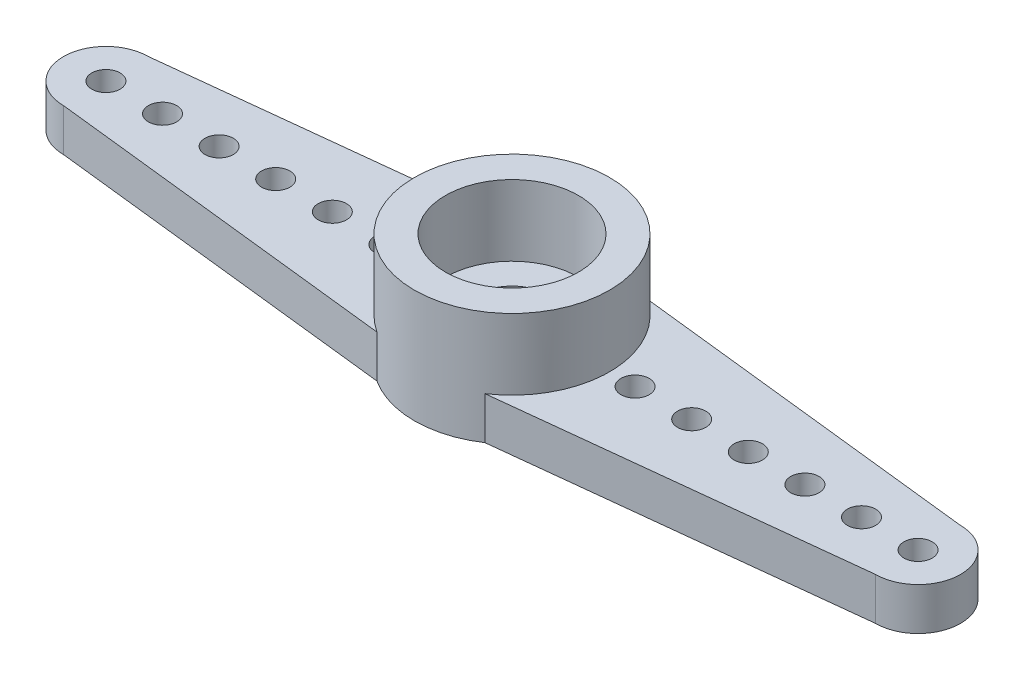
ISO-10303-21;
HEADER;
FILE_DESCRIPTION(('STEP AP214'),'2;1');
FILE_NAME('part.step','',(''),(''),'','','');
FILE_SCHEMA(('AUTOMOTIVE_DESIGN { 1 0 10303 214 1 1 1 1 }'));
ENDSEC;
DATA;
#1=APPLICATION_CONTEXT('core data for automotive mechanical design processes');
#2=APPLICATION_PROTOCOL_DEFINITION('international standard','automotive_design',2000,#1);
#3=PRODUCT_CONTEXT('',#1,'mechanical');
#4=PRODUCT('Part','Part','',(#3));
#5=PRODUCT_RELATED_PRODUCT_CATEGORY('part','',(#4));
#6=PRODUCT_DEFINITION_FORMATION('','',#4);
#7=PRODUCT_DEFINITION_CONTEXT('part definition',#1,'design');
#8=PRODUCT_DEFINITION('design','',#6,#7);
#9=PRODUCT_DEFINITION_SHAPE('','',#8);
#10=(LENGTH_UNIT() NAMED_UNIT(*) SI_UNIT(.MILLI.,.METRE.));
#11=(NAMED_UNIT(*) PLANE_ANGLE_UNIT() SI_UNIT($,.RADIAN.));
#12=(NAMED_UNIT(*) SI_UNIT($,.STERADIAN.) SOLID_ANGLE_UNIT());
#13=UNCERTAINTY_MEASURE_WITH_UNIT(LENGTH_MEASURE(1.E-05),#10,'distance_accuracy_value','');
#14=(GEOMETRIC_REPRESENTATION_CONTEXT(3) GLOBAL_UNCERTAINTY_ASSIGNED_CONTEXT((#13)) GLOBAL_UNIT_ASSIGNED_CONTEXT((#10,
#11,#12)) REPRESENTATION_CONTEXT('',''));
#15=CARTESIAN_POINT('',(0.,0.,0.));
#16=DIRECTION('',(0.,0.,1.));
#17=DIRECTION('',(1.,0.,0.));
#18=AXIS2_PLACEMENT_3D('',#15,#16,#17);
#19=CARTESIAN_POINT('',(0.,1.5,0.));
#20=DIRECTION('',(0.,1.,0.));
#21=DIRECTION('',(0.,0.,1.));
#22=AXIS2_PLACEMENT_3D('',#19,#20,#21);
#23=PLANE('',#22);
#24=CARTESIAN_POINT('',(0.,1.5,0.));
#25=DIRECTION('',(0.,1.,0.));
#26=DIRECTION('',(0.,0.,1.));
#27=AXIS2_PLACEMENT_3D('',#24,#25,#26);
#28=CIRCLE('',#27,1.275);
#29=CARTESIAN_POINT('',(0.,1.5,1.275));
#30=VERTEX_POINT('',#29);
#31=EDGE_CURVE('E40',#30,#30,#28,.T.);
#32=ORIENTED_EDGE('',*,*,#31,.F.);
#33=EDGE_LOOP('',(#32));
#34=FACE_BOUND('',#33,.T.);
#35=CARTESIAN_POINT('',(0.,1.5,0.));
#36=DIRECTION('',(0.,1.,0.));
#37=DIRECTION('',(0.,0.,1.));
#38=AXIS2_PLACEMENT_3D('',#35,#36,#37);
#39=CIRCLE('',#38,2.35);
#40=CARTESIAN_POINT('',(0.,1.5,2.35));
#41=VERTEX_POINT('',#40);
#42=EDGE_CURVE('E202',#41,#41,#39,.T.);
#43=ORIENTED_EDGE('',*,*,#42,.T.);
#44=EDGE_LOOP('',(#43));
#45=FACE_BOUND('',#44,.T.);
#46=ADVANCED_FACE('F36',(#34,#45),#23,.T.);
#47=CARTESIAN_POINT('',(0.,1.5,0.));
#48=DIRECTION('',(0.,1.,0.));
#49=DIRECTION('',(0.,0.,1.));
#50=AXIS2_PLACEMENT_3D('',#47,#48,#49);
#51=CIRCLE('',#50,3.45);
#52=CARTESIAN_POINT('',(1.913197247407,1.5,2.87091906756604));
#53=VERTEX_POINT('',#52);
#54=CARTESIAN_POINT('',(1.87974276835085,1.5,-2.89293399939105));
#55=VERTEX_POINT('',#54);
#56=EDGE_CURVE('E48',#53,#55,#51,.T.);
#57=ORIENTED_EDGE('',*,*,#56,.F.);
#58=DIRECTION('',(0.993979393584622,0.,-0.109567171767582));
#59=VECTOR('',#58,1.);
#60=CARTESIAN_POINT('',(1.913197247407,1.5,2.87091906756604));
#61=LINE('',#60,#59);
#62=CARTESIAN_POINT('',(14.35,1.5,1.5));
#63=VERTEX_POINT('',#62);
#64=EDGE_CURVE('E56',#53,#63,#61,.T.);
#65=ORIENTED_EDGE('',*,*,#64,.T.);
#66=CARTESIAN_POINT('',(14.35,1.5,0.));
#67=DIRECTION('',(0.,1.,0.));
#68=DIRECTION('',(0.,0.,1.));
#69=AXIS2_PLACEMENT_3D('',#66,#67,#68);
#70=CIRCLE('',#69,1.5);
#71=CARTESIAN_POINT('',(14.35,1.5,-1.5));
#72=VERTEX_POINT('',#71);
#73=EDGE_CURVE('E158',#63,#72,#70,.T.);
#74=ORIENTED_EDGE('',*,*,#73,.T.);
#75=DIRECTION('',(-0.993819276776604,0.,-0.111010112634965));
#76=VECTOR('',#75,1.);
#77=CARTESIAN_POINT('',(14.35,1.5,-1.5));
#78=LINE('',#77,#76);
#79=EDGE_CURVE('E102',#72,#55,#78,.T.);
#80=ORIENTED_EDGE('',*,*,#79,.T.);
#81=EDGE_LOOP('',(#57,#65,#74,#80));
#82=FACE_BOUND('',#81,.T.);
#83=CARTESIAN_POINT('',(4.35,1.5,0.));
#84=DIRECTION('',(0.,1.,0.));
#85=DIRECTION('',(0.,0.,1.));
#86=AXIS2_PLACEMENT_3D('',#83,#84,#85);
#87=CIRCLE('',#86,0.500000000000001);
#88=CARTESIAN_POINT('',(4.35,1.5,0.500000000000001));
#89=VERTEX_POINT('',#88);
#90=EDGE_CURVE('E248',#89,#89,#87,.T.);
#91=ORIENTED_EDGE('',*,*,#90,.F.);
#92=EDGE_LOOP('',(#91));
#93=FACE_BOUND('',#92,.T.);
#94=CARTESIAN_POINT('',(14.35,1.5,0.));
#95=DIRECTION('',(0.,1.,0.));
#96=DIRECTION('',(0.,0.,1.));
#97=AXIS2_PLACEMENT_3D('',#94,#95,#96);
#98=CIRCLE('',#97,0.499999999999999);
#99=CARTESIAN_POINT('',(14.35,1.5,0.499999999999999));
#100=VERTEX_POINT('',#99);
#101=EDGE_CURVE('E260',#100,#100,#98,.T.);
#102=ORIENTED_EDGE('',*,*,#101,.F.);
#103=EDGE_LOOP('',(#102));
#104=FACE_BOUND('',#103,.T.);
#105=CARTESIAN_POINT('',(10.35,1.5,0.));
#106=DIRECTION('',(0.,1.,0.));
#107=DIRECTION('',(0.,0.,1.));
#108=AXIS2_PLACEMENT_3D('',#105,#106,#107);
#109=CIRCLE('',#108,0.500000000000001);
#110=CARTESIAN_POINT('',(10.35,1.5,0.500000000000001));
#111=VERTEX_POINT('',#110);
#112=EDGE_CURVE('E272',#111,#111,#109,.T.);
#113=ORIENTED_EDGE('',*,*,#112,.F.);
#114=EDGE_LOOP('',(#113));
#115=FACE_BOUND('',#114,.T.);
#116=CARTESIAN_POINT('',(12.35,1.5,0.));
#117=DIRECTION('',(0.,1.,0.));
#118=DIRECTION('',(0.,0.,1.));
#119=AXIS2_PLACEMENT_3D('',#116,#117,#118);
#120=CIRCLE('',#119,0.500000000000001);
#121=CARTESIAN_POINT('',(12.35,1.5,0.500000000000001));
#122=VERTEX_POINT('',#121);
#123=EDGE_CURVE('E278',#122,#122,#120,.T.);
#124=ORIENTED_EDGE('',*,*,#123,.F.);
#125=EDGE_LOOP('',(#124));
#126=FACE_BOUND('',#125,.T.);
#127=CARTESIAN_POINT('',(8.35,1.5,0.));
#128=DIRECTION('',(0.,1.,0.));
#129=DIRECTION('',(0.,0.,1.));
#130=AXIS2_PLACEMENT_3D('',#127,#128,#129);
#131=CIRCLE('',#130,0.500000000000001);
#132=CARTESIAN_POINT('',(8.35,1.5,0.500000000000001));
#133=VERTEX_POINT('',#132);
#134=EDGE_CURVE('E266',#133,#133,#131,.T.);
#135=ORIENTED_EDGE('',*,*,#134,.F.);
#136=EDGE_LOOP('',(#135));
#137=FACE_BOUND('',#136,.T.);
#138=CARTESIAN_POINT('',(6.35,1.5,0.));
#139=DIRECTION('',(0.,1.,0.));
#140=DIRECTION('',(0.,0.,1.));
#141=AXIS2_PLACEMENT_3D('',#138,#139,#140);
#142=CIRCLE('',#141,0.5);
#143=CARTESIAN_POINT('',(6.35,1.5,0.5));
#144=VERTEX_POINT('',#143);
#145=EDGE_CURVE('E254',#144,#144,#142,.T.);
#146=ORIENTED_EDGE('',*,*,#145,.F.);
#147=EDGE_LOOP('',(#146));
#148=FACE_BOUND('',#147,.T.);
#149=ADVANCED_FACE('F188',(#82,#93,#104,#115,#126,#137,#148),#23,.T.);
#150=CARTESIAN_POINT('',(0.,1.,0.));
#151=DIRECTION('',(0.,1.,0.));
#152=DIRECTION('',(0.,0.,1.));
#153=AXIS2_PLACEMENT_3D('',#150,#151,#152);
#154=CYLINDRICAL_SURFACE('',#153,1.275);
#155=CARTESIAN_POINT('',(0.,1.,0.));
#156=DIRECTION('',(0.,1.,0.));
#157=DIRECTION('',(0.,0.,1.));
#158=AXIS2_PLACEMENT_3D('',#155,#156,#157);
#159=CIRCLE('',#158,1.275);
#160=CARTESIAN_POINT('',(0.,1.,1.275));
#161=VERTEX_POINT('',#160);
#162=EDGE_CURVE('E172',#161,#161,#159,.T.);
#163=ORIENTED_EDGE('',*,*,#162,.F.);
#164=EDGE_LOOP('',(#163));
#165=FACE_BOUND('',#164,.T.);
#166=ORIENTED_EDGE('',*,*,#31,.T.);
#167=EDGE_LOOP('',(#166));
#168=FACE_BOUND('',#167,.T.);
#169=ADVANCED_FACE('F38',(#165,#168),#154,.F.);
#170=CARTESIAN_POINT('',(0.,1.,0.));
#171=DIRECTION('',(0.,1.,0.));
#172=DIRECTION('',(0.,0.,1.));
#173=AXIS2_PLACEMENT_3D('',#170,#171,#172);
#174=PLANE('',#173);
#175=ORIENTED_EDGE('',*,*,#162,.T.);
#176=EDGE_LOOP('',(#175));
#177=FACE_BOUND('',#176,.T.);
#178=CARTESIAN_POINT('',(0.,1.,0.));
#179=DIRECTION('',(0.,1.,0.));
#180=DIRECTION('',(0.,0.,1.));
#181=AXIS2_PLACEMENT_3D('',#178,#179,#180);
#182=CIRCLE('',#181,2.35);
#183=CARTESIAN_POINT('',(0.,1.,2.35));
#184=VERTEX_POINT('',#183);
#185=EDGE_CURVE('E46',#184,#184,#182,.T.);
#186=ORIENTED_EDGE('',*,*,#185,.F.);
#187=EDGE_LOOP('',(#186));
#188=FACE_BOUND('',#187,.T.);
#189=ADVANCED_FACE('F179',(#177,#188),#174,.F.);
#190=CARTESIAN_POINT('',(-1.91319724740702,1.5,-2.87091906756603));
#191=VERTEX_POINT('',#190);
#192=CARTESIAN_POINT('',(-1.87974276835083,1.5,2.89293399939107));
#193=VERTEX_POINT('',#192);
#194=EDGE_CURVE('E11',#191,#193,#51,.T.);
#195=ORIENTED_EDGE('',*,*,#194,.F.);
#196=DIRECTION('',(-0.993979393584622,0.,0.109567171767589));
#197=VECTOR('',#196,1.);
#198=CARTESIAN_POINT('',(-1.91319724740702,1.5,-2.87091906756603));
#199=LINE('',#198,#197);
#200=CARTESIAN_POINT('',(-14.35,1.5,-1.4999999999999));
#201=VERTEX_POINT('',#200);
#202=EDGE_CURVE('E122',#191,#201,#199,.T.);
#203=ORIENTED_EDGE('',*,*,#202,.T.);
#204=CARTESIAN_POINT('',(-14.35,1.5,1.00613961606655E-13));
#205=DIRECTION('',(0.,1.,0.));
#206=DIRECTION('',(0.,0.,1.));
#207=AXIS2_PLACEMENT_3D('',#204,#205,#206);
#208=CIRCLE('',#207,1.5);
#209=CARTESIAN_POINT('',(-14.35,1.5,1.5000000000001));
#210=VERTEX_POINT('',#209);
#211=EDGE_CURVE('E114',#201,#210,#208,.T.);
#212=ORIENTED_EDGE('',*,*,#211,.T.);
#213=DIRECTION('',(0.993819276776605,0.,0.111010112634958));
#214=VECTOR('',#213,1.);
#215=CARTESIAN_POINT('',(-14.35,1.5,1.5000000000001));
#216=LINE('',#215,#214);
#217=EDGE_CURVE('E119',#210,#193,#216,.T.);
#218=ORIENTED_EDGE('',*,*,#217,.T.);
#219=EDGE_LOOP('',(#195,#203,#212,#218));
#220=FACE_BOUND('',#219,.T.);
#221=CARTESIAN_POINT('',(-6.35,1.5,0.));
#222=DIRECTION('',(0.,1.,0.));
#223=DIRECTION('',(0.,0.,1.));
#224=AXIS2_PLACEMENT_3D('',#221,#222,#223);
#225=CIRCLE('',#224,0.5);
#226=CARTESIAN_POINT('',(-6.35,1.5,0.500000000000044));
#227=VERTEX_POINT('',#226);
#228=EDGE_CURVE('E218',#227,#227,#225,.T.);
#229=ORIENTED_EDGE('',*,*,#228,.F.);
#230=EDGE_LOOP('',(#229));
#231=FACE_BOUND('',#230,.T.);
#232=CARTESIAN_POINT('',(-8.35,1.5,0.));
#233=DIRECTION('',(0.,1.,0.));
#234=DIRECTION('',(0.,0.,1.));
#235=AXIS2_PLACEMENT_3D('',#232,#233,#234);
#236=CIRCLE('',#235,0.5);
#237=CARTESIAN_POINT('',(-8.35,1.5,0.500000000000058));
#238=VERTEX_POINT('',#237);
#239=EDGE_CURVE('E230',#238,#238,#236,.T.);
#240=ORIENTED_EDGE('',*,*,#239,.F.);
#241=EDGE_LOOP('',(#240));
#242=FACE_BOUND('',#241,.T.);
#243=CARTESIAN_POINT('',(-12.35,1.5,0.));
#244=DIRECTION('',(0.,1.,0.));
#245=DIRECTION('',(0.,0.,1.));
#246=AXIS2_PLACEMENT_3D('',#243,#244,#245);
#247=CIRCLE('',#246,0.500000000000003);
#248=CARTESIAN_POINT('',(-12.35,1.5,0.50000000000009));
#249=VERTEX_POINT('',#248);
#250=EDGE_CURVE('E242',#249,#249,#247,.T.);
#251=ORIENTED_EDGE('',*,*,#250,.F.);
#252=EDGE_LOOP('',(#251));
#253=FACE_BOUND('',#252,.T.);
#254=CARTESIAN_POINT('',(-10.35,1.5,0.));
#255=DIRECTION('',(0.,1.,0.));
#256=DIRECTION('',(0.,0.,1.));
#257=AXIS2_PLACEMENT_3D('',#254,#255,#256);
#258=CIRCLE('',#257,0.5);
#259=CARTESIAN_POINT('',(-10.35,1.5,0.500000000000073));
#260=VERTEX_POINT('',#259);
#261=EDGE_CURVE('E236',#260,#260,#258,.T.);
#262=ORIENTED_EDGE('',*,*,#261,.F.);
#263=EDGE_LOOP('',(#262));
#264=FACE_BOUND('',#263,.T.);
#265=CARTESIAN_POINT('',(-14.35,1.5,1.00613961606655E-13));
#266=DIRECTION('',(0.,1.,0.));
#267=DIRECTION('',(0.,0.,1.));
#268=AXIS2_PLACEMENT_3D('',#265,#266,#267);
#269=CIRCLE('',#268,0.499999999999997);
#270=CARTESIAN_POINT('',(-14.35,1.5,0.500000000000097));
#271=VERTEX_POINT('',#270);
#272=EDGE_CURVE('E224',#271,#271,#269,.T.);
#273=ORIENTED_EDGE('',*,*,#272,.F.);
#274=EDGE_LOOP('',(#273));
#275=FACE_BOUND('',#274,.T.);
#276=CARTESIAN_POINT('',(-4.35,1.5,0.));
#277=DIRECTION('',(0.,1.,0.));
#278=DIRECTION('',(0.,0.,1.));
#279=AXIS2_PLACEMENT_3D('',#276,#277,#278);
#280=CIRCLE('',#279,0.5);
#281=CARTESIAN_POINT('',(-4.35,1.5,0.500000000000031));
#282=VERTEX_POINT('',#281);
#283=EDGE_CURVE('E211',#282,#282,#280,.T.);
#284=ORIENTED_EDGE('',*,*,#283,.F.);
#285=EDGE_LOOP('',(#284));
#286=FACE_BOUND('',#285,.T.);
#287=ADVANCED_FACE('F116',(#220,#231,#242,#253,#264,#275,#286),#23,.T.);
#288=CARTESIAN_POINT('',(0.,1.5,0.));
#289=DIRECTION('',(0.,-1.,0.));
#290=DIRECTION('',(0.,0.,-1.));
#291=AXIS2_PLACEMENT_3D('',#288,#289,#290);
#292=CYLINDRICAL_SURFACE('',#291,2.35);
#293=CARTESIAN_POINT('',(0.,0.,0.));
#294=DIRECTION('',(0.,1.,0.));
#295=DIRECTION('',(0.,0.,1.));
#296=AXIS2_PLACEMENT_3D('',#293,#294,#295);
#297=CIRCLE('',#296,2.35);
#298=CARTESIAN_POINT('',(0.,0.,2.35));
#299=VERTEX_POINT('',#298);
#300=EDGE_CURVE('E147',#299,#299,#297,.T.);
#301=ORIENTED_EDGE('',*,*,#300,.F.);
#302=EDGE_LOOP('',(#301));
#303=FACE_BOUND('',#302,.T.);
#304=ORIENTED_EDGE('',*,*,#185,.T.);
#305=EDGE_LOOP('',(#304));
#306=FACE_BOUND('',#305,.T.);
#307=ADVANCED_FACE('F177',(#303,#306),#292,.F.);
#308=CARTESIAN_POINT('',(14.35,0.,0.));
#309=DIRECTION('',(0.,1.,0.));
#310=DIRECTION('',(0.,0.,1.));
#311=AXIS2_PLACEMENT_3D('',#308,#309,#310);
#312=PLANE('',#311);
#313=CARTESIAN_POINT('',(14.35,0.,0.));
#314=DIRECTION('',(0.,1.,0.));
#315=DIRECTION('',(0.,0.,1.));
#316=AXIS2_PLACEMENT_3D('',#313,#314,#315);
#317=CIRCLE('',#316,1.5);
#318=CARTESIAN_POINT('',(14.35,0.,1.5));
#319=VERTEX_POINT('',#318);
#320=CARTESIAN_POINT('',(14.35,0.,-1.5));
#321=VERTEX_POINT('',#320);
#322=EDGE_CURVE('E143',#319,#321,#317,.T.);
#323=ORIENTED_EDGE('',*,*,#322,.F.);
#324=DIRECTION('',(0.993979393584622,0.,-0.109567171767582));
#325=VECTOR('',#324,1.);
#326=CARTESIAN_POINT('',(1.913197247407,0.,2.87091906756604));
#327=LINE('',#326,#325);
#328=CARTESIAN_POINT('',(1.913197247407,0.,2.87091906756604));
#329=VERTEX_POINT('',#328);
#330=EDGE_CURVE('E93',#329,#319,#327,.T.);
#331=ORIENTED_EDGE('',*,*,#330,.F.);
#332=CARTESIAN_POINT('',(0.,0.,0.));
#333=DIRECTION('',(0.,1.,0.));
#334=DIRECTION('',(0.,0.,1.));
#335=AXIS2_PLACEMENT_3D('',#332,#333,#334);
#336=CIRCLE('',#335,3.45);
#337=CARTESIAN_POINT('',(-1.87974276835083,0.,2.89293399939107));
#338=VERTEX_POINT('',#337);
#339=EDGE_CURVE('E87',#338,#329,#336,.T.);
#340=ORIENTED_EDGE('',*,*,#339,.F.);
#341=DIRECTION('',(0.993819276776605,0.,0.111010112634958));
#342=VECTOR('',#341,1.);
#343=CARTESIAN_POINT('',(-14.35,0.,1.5000000000001));
#344=LINE('',#343,#342);
#345=CARTESIAN_POINT('',(-14.35,0.,1.5000000000001));
#346=VERTEX_POINT('',#345);
#347=EDGE_CURVE('E154',#346,#338,#344,.T.);
#348=ORIENTED_EDGE('',*,*,#347,.F.);
#349=CARTESIAN_POINT('',(-14.35,0.,1.00613961606655E-13));
#350=DIRECTION('',(0.,1.,0.));
#351=DIRECTION('',(0.,0.,1.));
#352=AXIS2_PLACEMENT_3D('',#349,#350,#351);
#353=CIRCLE('',#352,1.5);
#354=CARTESIAN_POINT('',(-14.35,0.,-1.4999999999999));
#355=VERTEX_POINT('',#354);
#356=EDGE_CURVE('E131',#355,#346,#353,.T.);
#357=ORIENTED_EDGE('',*,*,#356,.F.);
#358=DIRECTION('',(-0.993979393584622,0.,0.109567171767589));
#359=VECTOR('',#358,1.);
#360=CARTESIAN_POINT('',(-1.91319724740702,0.,-2.87091906756603));
#361=LINE('',#360,#359);
#362=CARTESIAN_POINT('',(-1.91319724740702,0.,-2.87091906756603));
#363=VERTEX_POINT('',#362);
#364=EDGE_CURVE('E151',#363,#355,#361,.T.);
#365=ORIENTED_EDGE('',*,*,#364,.F.);
#366=CARTESIAN_POINT('',(0.,0.,0.));
#367=DIRECTION('',(0.,1.,0.));
#368=DIRECTION('',(0.,0.,1.));
#369=AXIS2_PLACEMENT_3D('',#366,#367,#368);
#370=CIRCLE('',#369,3.45);
#371=CARTESIAN_POINT('',(1.87974276835085,0.,-2.89293399939105));
#372=VERTEX_POINT('',#371);
#373=EDGE_CURVE('E149',#372,#363,#370,.T.);
#374=ORIENTED_EDGE('',*,*,#373,.F.);
#375=DIRECTION('',(-0.993819276776604,0.,-0.111010112634965));
#376=VECTOR('',#375,1.);
#377=CARTESIAN_POINT('',(14.35,0.,-1.5));
#378=LINE('',#377,#376);
#379=EDGE_CURVE('E146',#321,#372,#378,.T.);
#380=ORIENTED_EDGE('',*,*,#379,.F.);
#381=EDGE_LOOP('',(#323,#331,#340,#348,#357,#365,#374,#380));
#382=FACE_BOUND('',#381,.T.);
#383=ORIENTED_EDGE('',*,*,#300,.T.);
#384=EDGE_LOOP('',(#383));
#385=FACE_BOUND('',#384,.T.);
#386=CARTESIAN_POINT('',(12.35,0.,0.));
#387=DIRECTION('',(0.,1.,0.));
#388=DIRECTION('',(0.,0.,1.));
#389=AXIS2_PLACEMENT_3D('',#386,#387,#388);
#390=CIRCLE('',#389,0.500000000000001);
#391=CARTESIAN_POINT('',(12.35,0.,0.500000000000001));
#392=VERTEX_POINT('',#391);
#393=EDGE_CURVE('E275',#392,#392,#390,.T.);
#394=ORIENTED_EDGE('',*,*,#393,.T.);
#395=EDGE_LOOP('',(#394));
#396=FACE_BOUND('',#395,.T.);
#397=CARTESIAN_POINT('',(10.35,0.,0.));
#398=DIRECTION('',(0.,1.,0.));
#399=DIRECTION('',(0.,0.,1.));
#400=AXIS2_PLACEMENT_3D('',#397,#398,#399);
#401=CIRCLE('',#400,0.500000000000001);
#402=CARTESIAN_POINT('',(10.35,0.,0.500000000000001));
#403=VERTEX_POINT('',#402);
#404=EDGE_CURVE('E269',#403,#403,#401,.T.);
#405=ORIENTED_EDGE('',*,*,#404,.T.);
#406=EDGE_LOOP('',(#405));
#407=FACE_BOUND('',#406,.T.);
#408=CARTESIAN_POINT('',(8.35,0.,0.));
#409=DIRECTION('',(0.,1.,0.));
#410=DIRECTION('',(0.,0.,1.));
#411=AXIS2_PLACEMENT_3D('',#408,#409,#410);
#412=CIRCLE('',#411,0.500000000000001);
#413=CARTESIAN_POINT('',(8.35,0.,0.500000000000001));
#414=VERTEX_POINT('',#413);
#415=EDGE_CURVE('E263',#414,#414,#412,.T.);
#416=ORIENTED_EDGE('',*,*,#415,.T.);
#417=EDGE_LOOP('',(#416));
#418=FACE_BOUND('',#417,.T.);
#419=CARTESIAN_POINT('',(14.35,0.,0.));
#420=DIRECTION('',(0.,1.,0.));
#421=DIRECTION('',(0.,0.,1.));
#422=AXIS2_PLACEMENT_3D('',#419,#420,#421);
#423=CIRCLE('',#422,0.499999999999999);
#424=CARTESIAN_POINT('',(14.35,0.,0.499999999999999));
#425=VERTEX_POINT('',#424);
#426=EDGE_CURVE('E257',#425,#425,#423,.T.);
#427=ORIENTED_EDGE('',*,*,#426,.T.);
#428=EDGE_LOOP('',(#427));
#429=FACE_BOUND('',#428,.T.);
#430=CARTESIAN_POINT('',(6.35,0.,0.));
#431=DIRECTION('',(0.,1.,0.));
#432=DIRECTION('',(0.,0.,1.));
#433=AXIS2_PLACEMENT_3D('',#430,#431,#432);
#434=CIRCLE('',#433,0.5);
#435=CARTESIAN_POINT('',(6.35,0.,0.5));
#436=VERTEX_POINT('',#435);
#437=EDGE_CURVE('E251',#436,#436,#434,.T.);
#438=ORIENTED_EDGE('',*,*,#437,.T.);
#439=EDGE_LOOP('',(#438));
#440=FACE_BOUND('',#439,.T.);
#441=CARTESIAN_POINT('',(4.35,0.,0.));
#442=DIRECTION('',(0.,1.,0.));
#443=DIRECTION('',(0.,0.,1.));
#444=AXIS2_PLACEMENT_3D('',#441,#442,#443);
#445=CIRCLE('',#444,0.500000000000001);
#446=CARTESIAN_POINT('',(4.35,0.,0.500000000000001));
#447=VERTEX_POINT('',#446);
#448=EDGE_CURVE('E245',#447,#447,#445,.T.);
#449=ORIENTED_EDGE('',*,*,#448,.T.);
#450=EDGE_LOOP('',(#449));
#451=FACE_BOUND('',#450,.T.);
#452=CARTESIAN_POINT('',(-12.35,0.,0.));
#453=DIRECTION('',(0.,1.,0.));
#454=DIRECTION('',(0.,0.,1.));
#455=AXIS2_PLACEMENT_3D('',#452,#453,#454);
#456=CIRCLE('',#455,0.500000000000003);
#457=CARTESIAN_POINT('',(-12.35,0.,0.50000000000009));
#458=VERTEX_POINT('',#457);
#459=EDGE_CURVE('E239',#458,#458,#456,.T.);
#460=ORIENTED_EDGE('',*,*,#459,.T.);
#461=EDGE_LOOP('',(#460));
#462=FACE_BOUND('',#461,.T.);
#463=CARTESIAN_POINT('',(-10.35,0.,0.));
#464=DIRECTION('',(0.,1.,0.));
#465=DIRECTION('',(0.,0.,1.));
#466=AXIS2_PLACEMENT_3D('',#463,#464,#465);
#467=CIRCLE('',#466,0.5);
#468=CARTESIAN_POINT('',(-10.35,0.,0.500000000000073));
#469=VERTEX_POINT('',#468);
#470=EDGE_CURVE('E233',#469,#469,#467,.T.);
#471=ORIENTED_EDGE('',*,*,#470,.T.);
#472=EDGE_LOOP('',(#471));
#473=FACE_BOUND('',#472,.T.);
#474=CARTESIAN_POINT('',(-8.35,0.,0.));
#475=DIRECTION('',(0.,1.,0.));
#476=DIRECTION('',(0.,0.,1.));
#477=AXIS2_PLACEMENT_3D('',#474,#475,#476);
#478=CIRCLE('',#477,0.5);
#479=CARTESIAN_POINT('',(-8.35,0.,0.500000000000058));
#480=VERTEX_POINT('',#479);
#481=EDGE_CURVE('E227',#480,#480,#478,.T.);
#482=ORIENTED_EDGE('',*,*,#481,.T.);
#483=EDGE_LOOP('',(#482));
#484=FACE_BOUND('',#483,.T.);
#485=CARTESIAN_POINT('',(-14.35,0.,1.00613961606655E-13));
#486=DIRECTION('',(0.,1.,0.));
#487=DIRECTION('',(0.,0.,1.));
#488=AXIS2_PLACEMENT_3D('',#485,#486,#487);
#489=CIRCLE('',#488,0.499999999999997);
#490=CARTESIAN_POINT('',(-14.35,0.,0.500000000000097));
#491=VERTEX_POINT('',#490);
#492=EDGE_CURVE('E221',#491,#491,#489,.T.);
#493=ORIENTED_EDGE('',*,*,#492,.T.);
#494=EDGE_LOOP('',(#493));
#495=FACE_BOUND('',#494,.T.);
#496=CARTESIAN_POINT('',(-6.35,0.,0.));
#497=DIRECTION('',(0.,1.,0.));
#498=DIRECTION('',(0.,0.,1.));
#499=AXIS2_PLACEMENT_3D('',#496,#497,#498);
#500=CIRCLE('',#499,0.5);
#501=CARTESIAN_POINT('',(-6.35,0.,0.500000000000044));
#502=VERTEX_POINT('',#501);
#503=EDGE_CURVE('E214',#502,#502,#500,.T.);
#504=ORIENTED_EDGE('',*,*,#503,.T.);
#505=EDGE_LOOP('',(#504));
#506=FACE_BOUND('',#505,.T.);
#507=CARTESIAN_POINT('',(-4.35,0.,0.));
#508=DIRECTION('',(0.,1.,0.));
#509=DIRECTION('',(0.,0.,1.));
#510=AXIS2_PLACEMENT_3D('',#507,#508,#509);
#511=CIRCLE('',#510,0.5);
#512=CARTESIAN_POINT('',(-4.35,0.,0.500000000000031));
#513=VERTEX_POINT('',#512);
#514=EDGE_CURVE('E215',#513,#513,#511,.T.);
#515=ORIENTED_EDGE('',*,*,#514,.T.);
#516=EDGE_LOOP('',(#515));
#517=FACE_BOUND('',#516,.T.);
#518=ADVANCED_FACE('F296',(#382,#385,#396,#407,#418,#429,#440,#451,#462,#473,#484,#495,#506,
#517),#312,.F.);
#519=CARTESIAN_POINT('',(14.35,1.5,0.));
#520=DIRECTION('',(0.,-1.,0.));
#521=DIRECTION('',(0.,0.,-1.));
#522=AXIS2_PLACEMENT_3D('',#519,#520,#521);
#523=CYLINDRICAL_SURFACE('',#522,1.5);
#524=ORIENTED_EDGE('',*,*,#322,.T.);
#525=DIRECTION('',(0.,-1.,0.));
#526=VECTOR('',#525,1.);
#527=CARTESIAN_POINT('',(14.35,1.5,-1.5));
#528=LINE('',#527,#526);
#529=EDGE_CURVE('E170',#72,#321,#528,.T.);
#530=ORIENTED_EDGE('',*,*,#529,.F.);
#531=ORIENTED_EDGE('',*,*,#73,.F.);
#532=DIRECTION('',(0.,-1.,0.));
#533=VECTOR('',#532,1.);
#534=CARTESIAN_POINT('',(14.35,1.5,1.5));
#535=LINE('',#534,#533);
#536=EDGE_CURVE('E139',#63,#319,#535,.T.);
#537=ORIENTED_EDGE('',*,*,#536,.T.);
#538=EDGE_LOOP('',(#524,#530,#531,#537));
#539=FACE_BOUND('',#538,.T.);
#540=ADVANCED_FACE('F299',(#539),#523,.T.);
#541=CARTESIAN_POINT('',(14.35,1.5,-1.5));
#542=DIRECTION('',(-0.111010112634965,0.,0.993819276776604));
#543=DIRECTION('',(0.993819276776604,0.,0.111010112634965));
#544=AXIS2_PLACEMENT_3D('',#541,#542,#543);
#545=PLANE('',#544);
#546=ORIENTED_EDGE('',*,*,#379,.T.);
#547=DIRECTION('',(0.,-1.,0.));
#548=VECTOR('',#547,1.);
#549=CARTESIAN_POINT('',(1.87974276835085,1.5,-2.89293399939105));
#550=LINE('',#549,#548);
#551=EDGE_CURVE('E167',#55,#372,#550,.T.);
#552=ORIENTED_EDGE('',*,*,#551,.F.);
#553=ORIENTED_EDGE('',*,*,#79,.F.);
#554=ORIENTED_EDGE('',*,*,#529,.T.);
#555=EDGE_LOOP('',(#546,#552,#553,#554));
#556=FACE_BOUND('',#555,.T.);
#557=ADVANCED_FACE('F289',(#556),#545,.F.);
#558=CARTESIAN_POINT('',(0.,1.5,0.));
#559=DIRECTION('',(0.,-1.,0.));
#560=DIRECTION('',(0.,0.,-1.));
#561=AXIS2_PLACEMENT_3D('',#558,#559,#560);
#562=CYLINDRICAL_SURFACE('',#561,3.45);
#563=ORIENTED_EDGE('',*,*,#373,.T.);
#564=DIRECTION('',(0.,-1.,0.));
#565=VECTOR('',#564,1.);
#566=CARTESIAN_POINT('',(-1.91319724740702,1.5,-2.87091906756603));
#567=LINE('',#566,#565);
#568=EDGE_CURVE('E164',#191,#363,#567,.T.);
#569=ORIENTED_EDGE('',*,*,#568,.F.);
#570=ORIENTED_EDGE('',*,*,#194,.T.);
#571=DIRECTION('',(0.,-1.,0.));
#572=VECTOR('',#571,1.);
#573=CARTESIAN_POINT('',(-1.87974276835083,1.5,2.89293399939107));
#574=LINE('',#573,#572);
#575=EDGE_CURVE('E135',#193,#338,#574,.T.);
#576=ORIENTED_EDGE('',*,*,#575,.T.);
#577=ORIENTED_EDGE('',*,*,#339,.T.);
#578=DIRECTION('',(0.,-1.,0.));
#579=VECTOR('',#578,1.);
#580=CARTESIAN_POINT('',(1.913197247407,1.5,2.87091906756604));
#581=LINE('',#580,#579);
#582=EDGE_CURVE('E160',#53,#329,#581,.T.);
#583=ORIENTED_EDGE('',*,*,#582,.F.);
#584=ORIENTED_EDGE('',*,*,#56,.T.);
#585=ORIENTED_EDGE('',*,*,#551,.T.);
#586=EDGE_LOOP('',(#563,#569,#570,#576,#577,#583,#584,#585));
#587=FACE_BOUND('',#586,.T.);
#588=CARTESIAN_POINT('',(0.,4.,0.));
#589=DIRECTION('',(0.,1.,0.));
#590=DIRECTION('',(0.,0.,1.));
#591=AXIS2_PLACEMENT_3D('',#588,#589,#590);
#592=CIRCLE('',#591,3.45);
#593=CARTESIAN_POINT('',(0.,4.,3.45));
#594=VERTEX_POINT('',#593);
#595=EDGE_CURVE('E208',#594,#594,#592,.T.);
#596=ORIENTED_EDGE('',*,*,#595,.F.);
#597=EDGE_LOOP('',(#596));
#598=FACE_BOUND('',#597,.T.);
#599=ADVANCED_FACE('F291',(#587,#598),#562,.T.);
#600=CARTESIAN_POINT('',(-1.91319724740702,1.5,-2.87091906756603));
#601=DIRECTION('',(0.109567171767589,0.,0.993979393584621));
#602=DIRECTION('',(0.993979393584622,0.,-0.109567171767589));
#603=AXIS2_PLACEMENT_3D('',#600,#601,#602);
#604=PLANE('',#603);
#605=ORIENTED_EDGE('',*,*,#364,.T.);
#606=DIRECTION('',(0.,-1.,0.));
#607=VECTOR('',#606,1.);
#608=CARTESIAN_POINT('',(-14.35,1.5,-1.4999999999999));
#609=LINE('',#608,#607);
#610=EDGE_CURVE('E134',#201,#355,#609,.T.);
#611=ORIENTED_EDGE('',*,*,#610,.F.);
#612=ORIENTED_EDGE('',*,*,#202,.F.);
#613=ORIENTED_EDGE('',*,*,#568,.T.);
#614=EDGE_LOOP('',(#605,#611,#612,#613));
#615=FACE_BOUND('',#614,.T.);
#616=ADVANCED_FACE('F310',(#615),#604,.F.);
#617=CARTESIAN_POINT('',(-14.35,1.5,1.00613961606655E-13));
#618=DIRECTION('',(0.,-1.,0.));
#619=DIRECTION('',(0.,0.,-1.));
#620=AXIS2_PLACEMENT_3D('',#617,#618,#619);
#621=CYLINDRICAL_SURFACE('',#620,1.5);
#622=ORIENTED_EDGE('',*,*,#356,.T.);
#623=DIRECTION('',(0.,-1.,0.));
#624=VECTOR('',#623,1.);
#625=CARTESIAN_POINT('',(-14.35,1.5,1.5000000000001));
#626=LINE('',#625,#624);
#627=EDGE_CURVE('E128',#210,#346,#626,.T.);
#628=ORIENTED_EDGE('',*,*,#627,.F.);
#629=ORIENTED_EDGE('',*,*,#211,.F.);
#630=ORIENTED_EDGE('',*,*,#610,.T.);
#631=EDGE_LOOP('',(#622,#628,#629,#630));
#632=FACE_BOUND('',#631,.T.);
#633=ADVANCED_FACE('F129',(#632),#621,.T.);
#634=CARTESIAN_POINT('',(-14.35,1.5,1.5000000000001));
#635=DIRECTION('',(0.111010112634958,0.,-0.993819276776605));
#636=DIRECTION('',(-0.993819276776605,0.,-0.111010112634958));
#637=AXIS2_PLACEMENT_3D('',#634,#635,#636);
#638=PLANE('',#637);
#639=ORIENTED_EDGE('',*,*,#347,.T.);
#640=ORIENTED_EDGE('',*,*,#575,.F.);
#641=ORIENTED_EDGE('',*,*,#217,.F.);
#642=ORIENTED_EDGE('',*,*,#627,.T.);
#643=EDGE_LOOP('',(#639,#640,#641,#642));
#644=FACE_BOUND('',#643,.T.);
#645=ADVANCED_FACE('F137',(#644),#638,.F.);
#646=CARTESIAN_POINT('',(1.913197247407,1.5,2.87091906756604));
#647=DIRECTION('',(-0.109567171767582,0.,-0.993979393584622));
#648=DIRECTION('',(-0.993979393584622,0.,0.109567171767582));
#649=AXIS2_PLACEMENT_3D('',#646,#647,#648);
#650=PLANE('',#649);
#651=ORIENTED_EDGE('',*,*,#330,.T.);
#652=ORIENTED_EDGE('',*,*,#536,.F.);
#653=ORIENTED_EDGE('',*,*,#64,.F.);
#654=ORIENTED_EDGE('',*,*,#582,.T.);
#655=EDGE_LOOP('',(#651,#652,#653,#654));
#656=FACE_BOUND('',#655,.T.);
#657=ADVANCED_FACE('F293',(#656),#650,.F.);
#658=CARTESIAN_POINT('',(12.35,1.5,0.));
#659=DIRECTION('',(0.,-1.,0.));
#660=DIRECTION('',(0.,0.,-1.));
#661=AXIS2_PLACEMENT_3D('',#658,#659,#660);
#662=CYLINDRICAL_SURFACE('',#661,0.500000000000001);
#663=ORIENTED_EDGE('',*,*,#123,.T.);
#664=EDGE_LOOP('',(#663));
#665=FACE_BOUND('',#664,.T.);
#666=ORIENTED_EDGE('',*,*,#393,.F.);
#667=EDGE_LOOP('',(#666));
#668=FACE_BOUND('',#667,.T.);
#669=ADVANCED_FACE('F319',(#665,#668),#662,.F.);
#670=CARTESIAN_POINT('',(10.35,1.5,0.));
#671=DIRECTION('',(0.,-1.,0.));
#672=DIRECTION('',(0.,0.,-1.));
#673=AXIS2_PLACEMENT_3D('',#670,#671,#672);
#674=CYLINDRICAL_SURFACE('',#673,0.500000000000001);
#675=ORIENTED_EDGE('',*,*,#112,.T.);
#676=EDGE_LOOP('',(#675));
#677=FACE_BOUND('',#676,.T.);
#678=ORIENTED_EDGE('',*,*,#404,.F.);
#679=EDGE_LOOP('',(#678));
#680=FACE_BOUND('',#679,.T.);
#681=ADVANCED_FACE('F326',(#677,#680),#674,.F.);
#682=CARTESIAN_POINT('',(8.35,1.5,0.));
#683=DIRECTION('',(0.,-1.,0.));
#684=DIRECTION('',(0.,0.,-1.));
#685=AXIS2_PLACEMENT_3D('',#682,#683,#684);
#686=CYLINDRICAL_SURFACE('',#685,0.500000000000001);
#687=ORIENTED_EDGE('',*,*,#134,.T.);
#688=EDGE_LOOP('',(#687));
#689=FACE_BOUND('',#688,.T.);
#690=ORIENTED_EDGE('',*,*,#415,.F.);
#691=EDGE_LOOP('',(#690));
#692=FACE_BOUND('',#691,.T.);
#693=ADVANCED_FACE('F330',(#689,#692),#686,.F.);
#694=CARTESIAN_POINT('',(14.35,1.5,0.));
#695=DIRECTION('',(0.,-1.,0.));
#696=DIRECTION('',(0.,0.,-1.));
#697=AXIS2_PLACEMENT_3D('',#694,#695,#696);
#698=CYLINDRICAL_SURFACE('',#697,0.499999999999999);
#699=ORIENTED_EDGE('',*,*,#101,.T.);
#700=EDGE_LOOP('',(#699));
#701=FACE_BOUND('',#700,.T.);
#702=ORIENTED_EDGE('',*,*,#426,.F.);
#703=EDGE_LOOP('',(#702));
#704=FACE_BOUND('',#703,.T.);
#705=ADVANCED_FACE('F334',(#701,#704),#698,.F.);
#706=CARTESIAN_POINT('',(6.35,1.5,0.));
#707=DIRECTION('',(0.,-1.,0.));
#708=DIRECTION('',(0.,0.,-1.));
#709=AXIS2_PLACEMENT_3D('',#706,#707,#708);
#710=CYLINDRICAL_SURFACE('',#709,0.5);
#711=ORIENTED_EDGE('',*,*,#145,.T.);
#712=EDGE_LOOP('',(#711));
#713=FACE_BOUND('',#712,.T.);
#714=ORIENTED_EDGE('',*,*,#437,.F.);
#715=EDGE_LOOP('',(#714));
#716=FACE_BOUND('',#715,.T.);
#717=ADVANCED_FACE('F338',(#713,#716),#710,.F.);
#718=CARTESIAN_POINT('',(4.35,1.5,0.));
#719=DIRECTION('',(0.,-1.,0.));
#720=DIRECTION('',(0.,0.,-1.));
#721=AXIS2_PLACEMENT_3D('',#718,#719,#720);
#722=CYLINDRICAL_SURFACE('',#721,0.500000000000001);
#723=ORIENTED_EDGE('',*,*,#90,.T.);
#724=EDGE_LOOP('',(#723));
#725=FACE_BOUND('',#724,.T.);
#726=ORIENTED_EDGE('',*,*,#448,.F.);
#727=EDGE_LOOP('',(#726));
#728=FACE_BOUND('',#727,.T.);
#729=ADVANCED_FACE('F342',(#725,#728),#722,.F.);
#730=CARTESIAN_POINT('',(-12.35,1.5,0.));
#731=DIRECTION('',(0.,-1.,0.));
#732=DIRECTION('',(0.,0.,-1.));
#733=AXIS2_PLACEMENT_3D('',#730,#731,#732);
#734=CYLINDRICAL_SURFACE('',#733,0.500000000000003);
#735=ORIENTED_EDGE('',*,*,#250,.T.);
#736=EDGE_LOOP('',(#735));
#737=FACE_BOUND('',#736,.T.);
#738=ORIENTED_EDGE('',*,*,#459,.F.);
#739=EDGE_LOOP('',(#738));
#740=FACE_BOUND('',#739,.T.);
#741=ADVANCED_FACE('F346',(#737,#740),#734,.F.);
#742=CARTESIAN_POINT('',(-10.35,1.5,0.));
#743=DIRECTION('',(0.,-1.,0.));
#744=DIRECTION('',(0.,0.,-1.));
#745=AXIS2_PLACEMENT_3D('',#742,#743,#744);
#746=CYLINDRICAL_SURFACE('',#745,0.5);
#747=ORIENTED_EDGE('',*,*,#261,.T.);
#748=EDGE_LOOP('',(#747));
#749=FACE_BOUND('',#748,.T.);
#750=ORIENTED_EDGE('',*,*,#470,.F.);
#751=EDGE_LOOP('',(#750));
#752=FACE_BOUND('',#751,.T.);
#753=ADVANCED_FACE('F350',(#749,#752),#746,.F.);
#754=CARTESIAN_POINT('',(-8.35,1.5,0.));
#755=DIRECTION('',(0.,-1.,0.));
#756=DIRECTION('',(0.,0.,-1.));
#757=AXIS2_PLACEMENT_3D('',#754,#755,#756);
#758=CYLINDRICAL_SURFACE('',#757,0.5);
#759=ORIENTED_EDGE('',*,*,#239,.T.);
#760=EDGE_LOOP('',(#759));
#761=FACE_BOUND('',#760,.T.);
#762=ORIENTED_EDGE('',*,*,#481,.F.);
#763=EDGE_LOOP('',(#762));
#764=FACE_BOUND('',#763,.T.);
#765=ADVANCED_FACE('F354',(#761,#764),#758,.F.);
#766=CARTESIAN_POINT('',(-14.35,1.5,1.00613961606655E-13));
#767=DIRECTION('',(0.,-1.,0.));
#768=DIRECTION('',(0.,0.,-1.));
#769=AXIS2_PLACEMENT_3D('',#766,#767,#768);
#770=CYLINDRICAL_SURFACE('',#769,0.499999999999997);
#771=ORIENTED_EDGE('',*,*,#272,.T.);
#772=EDGE_LOOP('',(#771));
#773=FACE_BOUND('',#772,.T.);
#774=ORIENTED_EDGE('',*,*,#492,.F.);
#775=EDGE_LOOP('',(#774));
#776=FACE_BOUND('',#775,.T.);
#777=ADVANCED_FACE('F358',(#773,#776),#770,.F.);
#778=CARTESIAN_POINT('',(-6.35,1.5,0.));
#779=DIRECTION('',(0.,-1.,0.));
#780=DIRECTION('',(0.,0.,-1.));
#781=AXIS2_PLACEMENT_3D('',#778,#779,#780);
#782=CYLINDRICAL_SURFACE('',#781,0.5);
#783=ORIENTED_EDGE('',*,*,#228,.T.);
#784=EDGE_LOOP('',(#783));
#785=FACE_BOUND('',#784,.T.);
#786=ORIENTED_EDGE('',*,*,#503,.F.);
#787=EDGE_LOOP('',(#786));
#788=FACE_BOUND('',#787,.T.);
#789=ADVANCED_FACE('F362',(#785,#788),#782,.F.);
#790=CARTESIAN_POINT('',(-4.35,1.5,0.));
#791=DIRECTION('',(0.,-1.,0.));
#792=DIRECTION('',(0.,0.,-1.));
#793=AXIS2_PLACEMENT_3D('',#790,#791,#792);
#794=CYLINDRICAL_SURFACE('',#793,0.5);
#795=ORIENTED_EDGE('',*,*,#283,.T.);
#796=EDGE_LOOP('',(#795));
#797=FACE_BOUND('',#796,.T.);
#798=ORIENTED_EDGE('',*,*,#514,.F.);
#799=EDGE_LOOP('',(#798));
#800=FACE_BOUND('',#799,.T.);
#801=ADVANCED_FACE('F366',(#797,#800),#794,.F.);
#802=CARTESIAN_POINT('',(0.,4.,0.));
#803=DIRECTION('',(0.,-1.,0.));
#804=DIRECTION('',(0.,0.,-1.));
#805=AXIS2_PLACEMENT_3D('',#802,#803,#804);
#806=CYLINDRICAL_SURFACE('',#805,2.35);
#807=CARTESIAN_POINT('',(0.,4.,0.));
#808=DIRECTION('',(0.,1.,0.));
#809=DIRECTION('',(0.,0.,1.));
#810=AXIS2_PLACEMENT_3D('',#807,#808,#809);
#811=CIRCLE('',#810,2.35);
#812=CARTESIAN_POINT('',(0.,4.,2.35));
#813=VERTEX_POINT('',#812);
#814=EDGE_CURVE('E206',#813,#813,#811,.T.);
#815=ORIENTED_EDGE('',*,*,#814,.T.);
#816=EDGE_LOOP('',(#815));
#817=FACE_BOUND('',#816,.T.);
#818=ORIENTED_EDGE('',*,*,#42,.F.);
#819=EDGE_LOOP('',(#818));
#820=FACE_BOUND('',#819,.T.);
#821=ADVANCED_FACE('F370',(#817,#820),#806,.F.);
#822=CARTESIAN_POINT('',(0.,4.,0.));
#823=DIRECTION('',(0.,1.,0.));
#824=DIRECTION('',(0.,0.,1.));
#825=AXIS2_PLACEMENT_3D('',#822,#823,#824);
#826=PLANE('',#825);
#827=ORIENTED_EDGE('',*,*,#814,.F.);
#828=EDGE_LOOP('',(#827));
#829=FACE_BOUND('',#828,.T.);
#830=ORIENTED_EDGE('',*,*,#595,.T.);
#831=EDGE_LOOP('',(#830));
#832=FACE_BOUND('',#831,.T.);
#833=ADVANCED_FACE('F374',(#829,#832),#826,.T.);
#834=CLOSED_SHELL('',(#46,#149,#169,#189,#287,#307,#518,#540,#557,#599,#616,#633,#645,#657,#669,
#681,#693,#705,#717,#729,#741,#753,#765,#777,#789,#801,#821,#833));
#835=MANIFOLD_SOLID_BREP('B2',#834);
#836=ADVANCED_BREP_SHAPE_REPRESENTATION('',(#18,#835),#14);
#837=SHAPE_DEFINITION_REPRESENTATION(#9,#836);
ENDSEC;
END-ISO-10303-21;
